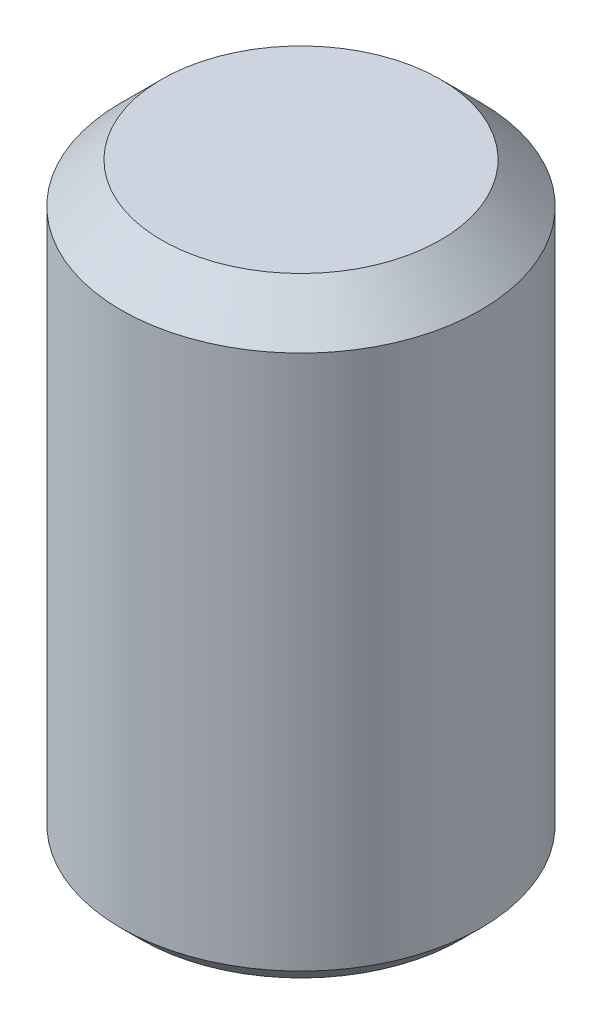
ISO-10303-21;
HEADER;
FILE_DESCRIPTION(('STEP AP214'),'2;1');
FILE_NAME('part.step','',(''),(''),'','','');
FILE_SCHEMA(('AUTOMOTIVE_DESIGN { 1 0 10303 214 1 1 1 1 }'));
ENDSEC;
DATA;
#1=APPLICATION_CONTEXT('core data for automotive mechanical design processes');
#2=APPLICATION_PROTOCOL_DEFINITION('international standard','automotive_design',2000,#1);
#3=PRODUCT_CONTEXT('',#1,'mechanical');
#4=PRODUCT('Part','Part','',(#3));
#5=PRODUCT_RELATED_PRODUCT_CATEGORY('part','',(#4));
#6=PRODUCT_DEFINITION_FORMATION('','',#4);
#7=PRODUCT_DEFINITION_CONTEXT('part definition',#1,'design');
#8=PRODUCT_DEFINITION('design','',#6,#7);
#9=PRODUCT_DEFINITION_SHAPE('','',#8);
#10=(LENGTH_UNIT() NAMED_UNIT(*) SI_UNIT(.MILLI.,.METRE.));
#11=(NAMED_UNIT(*) PLANE_ANGLE_UNIT() SI_UNIT($,.RADIAN.));
#12=(NAMED_UNIT(*) SI_UNIT($,.STERADIAN.) SOLID_ANGLE_UNIT());
#13=UNCERTAINTY_MEASURE_WITH_UNIT(LENGTH_MEASURE(1.E-05),#10,'distance_accuracy_value','');
#14=(GEOMETRIC_REPRESENTATION_CONTEXT(3) GLOBAL_UNCERTAINTY_ASSIGNED_CONTEXT((#13)) GLOBAL_UNIT_ASSIGNED_CONTEXT((#10,
#11,#12)) REPRESENTATION_CONTEXT('',''));
#15=CARTESIAN_POINT('',(0.,0.,0.));
#16=DIRECTION('',(0.,0.,1.));
#17=DIRECTION('',(1.,0.,0.));
#18=AXIS2_PLACEMENT_3D('',#15,#16,#17);
#19=CARTESIAN_POINT('',(0.,0.375,0.));
#20=DIRECTION('',(0.,-1.,0.));
#21=DIRECTION('',(0.,0.,-1.));
#22=AXIS2_PLACEMENT_3D('',#19,#20,#21);
#23=PLANE('',#22);
#24=DIRECTION('',(0.5,0.,0.866025403784439));
#25=VECTOR('',#24,1.);
#26=CARTESIAN_POINT('',(-0.235,0.375,0.407031939778686));
#27=LINE('',#26,#25);
#28=CARTESIAN_POINT('',(-0.235,0.375,0.407031939778686));
#29=VERTEX_POINT('',#28);
#30=CARTESIAN_POINT('',(-0.47,0.375,0.));
#31=VERTEX_POINT('',#30);
#32=EDGE_CURVE('E128',#29,#31,#27,.F.);
#33=ORIENTED_EDGE('',*,*,#32,.T.);
#34=DIRECTION('',(-0.5,0.,0.866025403784439));
#35=VECTOR('',#34,1.);
#36=CARTESIAN_POINT('',(-0.47,0.375,0.));
#37=LINE('',#36,#35);
#38=CARTESIAN_POINT('',(-0.235,0.375,-0.407031939778686));
#39=VERTEX_POINT('',#38);
#40=EDGE_CURVE('E123',#31,#39,#37,.F.);
#41=ORIENTED_EDGE('',*,*,#40,.T.);
#42=DIRECTION('',(-1.,0.,0.));
#43=VECTOR('',#42,1.);
#44=CARTESIAN_POINT('',(-0.235,0.375,-0.407031939778686));
#45=LINE('',#44,#43);
#46=CARTESIAN_POINT('',(0.235,0.375,-0.407031939778686));
#47=VERTEX_POINT('',#46);
#48=EDGE_CURVE('E73',#39,#47,#45,.F.);
#49=ORIENTED_EDGE('',*,*,#48,.T.);
#50=DIRECTION('',(-0.5,0.,-0.866025403784439));
#51=VECTOR('',#50,1.);
#52=CARTESIAN_POINT('',(0.235,0.375,-0.407031939778686));
#53=LINE('',#52,#51);
#54=CARTESIAN_POINT('',(0.47,0.375,0.));
#55=VERTEX_POINT('',#54);
#56=EDGE_CURVE('E70',#47,#55,#53,.F.);
#57=ORIENTED_EDGE('',*,*,#56,.T.);
#58=DIRECTION('',(0.5,0.,-0.866025403784439));
#59=VECTOR('',#58,1.);
#60=CARTESIAN_POINT('',(0.47,0.375,0.));
#61=LINE('',#60,#59);
#62=CARTESIAN_POINT('',(0.235,0.375,0.407031939778686));
#63=VERTEX_POINT('',#62);
#64=EDGE_CURVE('E67',#55,#63,#61,.F.);
#65=ORIENTED_EDGE('',*,*,#64,.T.);
#66=DIRECTION('',(1.,0.,0.));
#67=VECTOR('',#66,1.);
#68=CARTESIAN_POINT('',(0.235,0.375,0.407031939778686));
#69=LINE('',#68,#67);
#70=EDGE_CURVE('E90',#63,#29,#69,.F.);
#71=ORIENTED_EDGE('',*,*,#70,.T.);
#72=EDGE_LOOP('',(#33,#41,#49,#57,#65,#71));
#73=FACE_BOUND('',#72,.T.);
#74=ADVANCED_FACE('F16',(#73),#23,.T.);
#75=CARTESIAN_POINT('',(0.235,0.,-0.407031939778686));
#76=DIRECTION('',(0.866025403784439,0.,-0.5));
#77=DIRECTION('',(-0.5,0.,-0.866025403784439));
#78=AXIS2_PLACEMENT_3D('',#75,#76,#77);
#79=PLANE('',#78);
#80=DIRECTION('',(0.,1.,0.));
#81=VECTOR('',#80,1.);
#82=CARTESIAN_POINT('',(0.47,0.,0.));
#83=LINE('',#82,#81);
#84=CARTESIAN_POINT('',(0.47,0.,0.));
#85=VERTEX_POINT('',#84);
#86=EDGE_CURVE('E76',#85,#55,#83,.T.);
#87=ORIENTED_EDGE('',*,*,#86,.T.);
#88=ORIENTED_EDGE('',*,*,#56,.F.);
#89=DIRECTION('',(0.,1.,0.));
#90=VECTOR('',#89,1.);
#91=CARTESIAN_POINT('',(0.235,0.,-0.407031939778686));
#92=LINE('',#91,#90);
#93=CARTESIAN_POINT('',(0.235,0.,-0.407031939778686));
#94=VERTEX_POINT('',#93);
#95=EDGE_CURVE('E118',#47,#94,#92,.F.);
#96=ORIENTED_EDGE('',*,*,#95,.T.);
#97=DIRECTION('',(0.5,0.,0.866025403784439));
#98=VECTOR('',#97,1.);
#99=CARTESIAN_POINT('',(0.235,0.,-0.407031939778686));
#100=LINE('',#99,#98);
#101=EDGE_CURVE('E81',#94,#85,#100,.T.);
#102=ORIENTED_EDGE('',*,*,#101,.T.);
#103=EDGE_LOOP('',(#87,#88,#96,#102));
#104=FACE_BOUND('',#103,.T.);
#105=ADVANCED_FACE('F79',(#104),#79,.F.);
#106=CARTESIAN_POINT('',(0.47,0.,0.));
#107=DIRECTION('',(0.866025403784439,0.,0.5));
#108=DIRECTION('',(0.5,0.,-0.866025403784439));
#109=AXIS2_PLACEMENT_3D('',#106,#107,#108);
#110=PLANE('',#109);
#111=DIRECTION('',(0.,1.,0.));
#112=VECTOR('',#111,1.);
#113=CARTESIAN_POINT('',(0.235,0.,0.407031939778686));
#114=LINE('',#113,#112);
#115=CARTESIAN_POINT('',(0.235,0.,0.407031939778686));
#116=VERTEX_POINT('',#115);
#117=EDGE_CURVE('E87',#116,#63,#114,.T.);
#118=ORIENTED_EDGE('',*,*,#117,.T.);
#119=ORIENTED_EDGE('',*,*,#64,.F.);
#120=ORIENTED_EDGE('',*,*,#86,.F.);
#121=DIRECTION('',(-0.5,0.,0.866025403784439));
#122=VECTOR('',#121,1.);
#123=CARTESIAN_POINT('',(0.47,0.,0.));
#124=LINE('',#123,#122);
#125=EDGE_CURVE('E115',#85,#116,#124,.T.);
#126=ORIENTED_EDGE('',*,*,#125,.T.);
#127=EDGE_LOOP('',(#118,#119,#120,#126));
#128=FACE_BOUND('',#127,.T.);
#129=ADVANCED_FACE('F85',(#128),#110,.F.);
#130=CARTESIAN_POINT('',(0.235,0.,0.407031939778686));
#131=DIRECTION('',(0.,0.,1.));
#132=DIRECTION('',(1.,0.,0.));
#133=AXIS2_PLACEMENT_3D('',#130,#131,#132);
#134=PLANE('',#133);
#135=DIRECTION('',(0.,1.,0.));
#136=VECTOR('',#135,1.);
#137=CARTESIAN_POINT('',(-0.235,0.,0.407031939778686));
#138=LINE('',#137,#136);
#139=CARTESIAN_POINT('',(-0.235,0.,0.407031939778686));
#140=VERTEX_POINT('',#139);
#141=EDGE_CURVE('E130',#140,#29,#138,.T.);
#142=ORIENTED_EDGE('',*,*,#141,.T.);
#143=ORIENTED_EDGE('',*,*,#70,.F.);
#144=ORIENTED_EDGE('',*,*,#117,.F.);
#145=DIRECTION('',(1.,0.,0.));
#146=VECTOR('',#145,1.);
#147=CARTESIAN_POINT('',(0.,0.,0.407031939778686));
#148=LINE('',#147,#146);
#149=EDGE_CURVE('E113',#116,#140,#148,.F.);
#150=ORIENTED_EDGE('',*,*,#149,.T.);
#151=EDGE_LOOP('',(#142,#143,#144,#150));
#152=FACE_BOUND('',#151,.T.);
#153=ADVANCED_FACE('F135',(#152),#134,.F.);
#154=CARTESIAN_POINT('',(-0.235,0.,0.407031939778686));
#155=DIRECTION('',(-0.866025403784439,0.,0.5));
#156=DIRECTION('',(0.5,0.,0.866025403784439));
#157=AXIS2_PLACEMENT_3D('',#154,#155,#156);
#158=PLANE('',#157);
#159=DIRECTION('',(0.,1.,0.));
#160=VECTOR('',#159,1.);
#161=CARTESIAN_POINT('',(-0.47,0.,0.));
#162=LINE('',#161,#160);
#163=CARTESIAN_POINT('',(-0.47,0.,0.));
#164=VERTEX_POINT('',#163);
#165=EDGE_CURVE('E125',#164,#31,#162,.T.);
#166=ORIENTED_EDGE('',*,*,#165,.T.);
#167=ORIENTED_EDGE('',*,*,#32,.F.);
#168=ORIENTED_EDGE('',*,*,#141,.F.);
#169=DIRECTION('',(-0.5,0.,-0.866025403784438));
#170=VECTOR('',#169,1.);
#171=CARTESIAN_POINT('',(-0.235,0.,0.407031939778686));
#172=LINE('',#171,#170);
#173=EDGE_CURVE('E107',#140,#164,#172,.T.);
#174=ORIENTED_EDGE('',*,*,#173,.T.);
#175=EDGE_LOOP('',(#166,#167,#168,#174));
#176=FACE_BOUND('',#175,.T.);
#177=ADVANCED_FACE('F139',(#176),#158,.F.);
#178=CARTESIAN_POINT('',(-0.47,0.,0.));
#179=DIRECTION('',(-0.866025403784439,0.,-0.5));
#180=DIRECTION('',(-0.5,0.,0.866025403784439));
#181=AXIS2_PLACEMENT_3D('',#178,#179,#180);
#182=PLANE('',#181);
#183=DIRECTION('',(0.,1.,0.));
#184=VECTOR('',#183,1.);
#185=CARTESIAN_POINT('',(-0.235,0.,-0.407031939778686));
#186=LINE('',#185,#184);
#187=CARTESIAN_POINT('',(-0.235,0.,-0.407031939778686));
#188=VERTEX_POINT('',#187);
#189=EDGE_CURVE('E121',#188,#39,#186,.T.);
#190=ORIENTED_EDGE('',*,*,#189,.T.);
#191=ORIENTED_EDGE('',*,*,#40,.F.);
#192=ORIENTED_EDGE('',*,*,#165,.F.);
#193=DIRECTION('',(0.5,0.,-0.866025403784439));
#194=VECTOR('',#193,1.);
#195=CARTESIAN_POINT('',(-0.47,0.,0.));
#196=LINE('',#195,#194);
#197=EDGE_CURVE('E34',#164,#188,#196,.T.);
#198=ORIENTED_EDGE('',*,*,#197,.T.);
#199=EDGE_LOOP('',(#190,#191,#192,#198));
#200=FACE_BOUND('',#199,.T.);
#201=ADVANCED_FACE('F141',(#200),#182,.F.);
#202=CARTESIAN_POINT('',(-0.235,0.,-0.407031939778686));
#203=DIRECTION('',(0.,0.,-1.));
#204=DIRECTION('',(-1.,0.,0.));
#205=AXIS2_PLACEMENT_3D('',#202,#203,#204);
#206=PLANE('',#205);
#207=ORIENTED_EDGE('',*,*,#95,.F.);
#208=ORIENTED_EDGE('',*,*,#48,.F.);
#209=ORIENTED_EDGE('',*,*,#189,.F.);
#210=DIRECTION('',(1.,0.,0.));
#211=VECTOR('',#210,1.);
#212=CARTESIAN_POINT('',(0.,0.,-0.407031939778686));
#213=LINE('',#212,#211);
#214=EDGE_CURVE('E100',#188,#94,#213,.T.);
#215=ORIENTED_EDGE('',*,*,#214,.T.);
#216=EDGE_LOOP('',(#207,#208,#209,#215));
#217=FACE_BOUND('',#216,.T.);
#218=ADVANCED_FACE('F142',(#217),#206,.F.);
#219=CARTESIAN_POINT('',(0.,0.,0.));
#220=DIRECTION('',(0.,1.,0.));
#221=DIRECTION('',(0.,0.,1.));
#222=AXIS2_PLACEMENT_3D('',#219,#220,#221);
#223=PLANE('',#222);
#224=ORIENTED_EDGE('',*,*,#197,.F.);
#225=ORIENTED_EDGE('',*,*,#173,.F.);
#226=ORIENTED_EDGE('',*,*,#149,.F.);
#227=ORIENTED_EDGE('',*,*,#125,.F.);
#228=ORIENTED_EDGE('',*,*,#101,.F.);
#229=ORIENTED_EDGE('',*,*,#214,.F.);
#230=EDGE_LOOP('',(#224,#225,#226,#227,#228,#229));
#231=FACE_BOUND('',#230,.T.);
#232=CARTESIAN_POINT('',(0.,5.68434324133352E-11,0.));
#233=DIRECTION('',(0.,1.,0.));
#234=DIRECTION('',(0.,0.,1.));
#235=AXIS2_PLACEMENT_3D('',#232,#233,#234);
#236=CIRCLE('',#235,0.790000000051804);
#237=CARTESIAN_POINT('',(0.,5.68434324133352E-11,0.790000000051803));
#238=VERTEX_POINT('',#237);
#239=EDGE_CURVE('E19',#238,#238,#236,.T.);
#240=ORIENTED_EDGE('',*,*,#239,.F.);
#241=EDGE_LOOP('',(#240));
#242=FACE_BOUND('',#241,.T.);
#243=ADVANCED_FACE('F144',(#231,#242),#223,.F.);
#244=CARTESIAN_POINT('',(0.,2.95,0.));
#245=DIRECTION('',(0.,1.,0.));
#246=DIRECTION('',(0.,0.,1.));
#247=AXIS2_PLACEMENT_3D('',#244,#245,#246);
#248=PLANE('',#247);
#249=CARTESIAN_POINT('',(0.,2.94999999999845,0.));
#250=DIRECTION('',(0.,-1.,0.));
#251=DIRECTION('',(0.,0.,-1.));
#252=AXIS2_PLACEMENT_3D('',#249,#250,#251);
#253=CIRCLE('',#252,0.690000000020063);
#254=CARTESIAN_POINT('',(0.,2.94999999999845,-0.690000000020063));
#255=VERTEX_POINT('',#254);
#256=EDGE_CURVE('E93',#255,#255,#253,.T.);
#257=ORIENTED_EDGE('',*,*,#256,.F.);
#258=EDGE_LOOP('',(#257));
#259=FACE_BOUND('',#258,.T.);
#260=ADVANCED_FACE('F151',(#259),#248,.T.);
#261=CARTESIAN_POINT('',(0.,0.0999999998612111,0.));
#262=DIRECTION('',(0.,1.,0.));
#263=DIRECTION('',(0.,0.,1.));
#264=AXIS2_PLACEMENT_3D('',#261,#262,#263);
#265=CONICAL_SURFACE('',#264,0.889999999913015,0.785398163681665);
#266=CARTESIAN_POINT('',(0.,0.1,0.));
#267=DIRECTION('',(0.,1.,0.));
#268=DIRECTION('',(0.,0.,1.));
#269=AXIS2_PLACEMENT_3D('',#266,#267,#268);
#270=CIRCLE('',#269,0.89);
#271=CARTESIAN_POINT('',(0.,0.1,0.89));
#272=VERTEX_POINT('',#271);
#273=EDGE_CURVE('E25',#272,#272,#270,.T.);
#274=ORIENTED_EDGE('',*,*,#273,.F.);
#275=EDGE_LOOP('',(#274));
#276=FACE_BOUND('',#275,.T.);
#277=ORIENTED_EDGE('',*,*,#239,.T.);
#278=EDGE_LOOP('',(#277));
#279=FACE_BOUND('',#278,.T.);
#280=ADVANCED_FACE('F163',(#276,#279),#265,.T.);
#281=CARTESIAN_POINT('',(0.,2.75000000004866,0.));
#282=DIRECTION('',(0.,-1.,0.));
#283=DIRECTION('',(0.,0.,-1.));
#284=AXIS2_PLACEMENT_3D('',#281,#282,#283);
#285=CONICAL_SURFACE('',#284,0.889999999913016,0.78539816325534);
#286=CARTESIAN_POINT('',(0.,2.75,0.));
#287=DIRECTION('',(0.,1.,0.));
#288=DIRECTION('',(0.,0.,1.));
#289=AXIS2_PLACEMENT_3D('',#286,#287,#288);
#290=CIRCLE('',#289,0.89);
#291=CARTESIAN_POINT('',(0.,2.75,0.89));
#292=VERTEX_POINT('',#291);
#293=EDGE_CURVE('E10',#292,#292,#290,.F.);
#294=ORIENTED_EDGE('',*,*,#293,.F.);
#295=EDGE_LOOP('',(#294));
#296=FACE_BOUND('',#295,.T.);
#297=ORIENTED_EDGE('',*,*,#256,.T.);
#298=EDGE_LOOP('',(#297));
#299=FACE_BOUND('',#298,.T.);
#300=ADVANCED_FACE('F157',(#296,#299),#285,.T.);
#301=CARTESIAN_POINT('',(0.,0.,0.));
#302=DIRECTION('',(0.,1.,0.));
#303=DIRECTION('',(0.,0.,1.));
#304=AXIS2_PLACEMENT_3D('',#301,#302,#303);
#305=CYLINDRICAL_SURFACE('',#304,0.89);
#306=ORIENTED_EDGE('',*,*,#293,.T.);
#307=EDGE_LOOP('',(#306));
#308=FACE_BOUND('',#307,.T.);
#309=ORIENTED_EDGE('',*,*,#273,.T.);
#310=EDGE_LOOP('',(#309));
#311=FACE_BOUND('',#310,.T.);
#312=ADVANCED_FACE('F155',(#308,#311),#305,.T.);
#313=CLOSED_SHELL('',(#74,#105,#129,#153,#177,#201,#218,#243,#260,#280,#300,#312));
#314=MANIFOLD_SOLID_BREP('B1',#313);
#315=ADVANCED_BREP_SHAPE_REPRESENTATION('',(#18,#314),#14);
#316=SHAPE_DEFINITION_REPRESENTATION(#9,#315);
ENDSEC;
END-ISO-10303-21;
